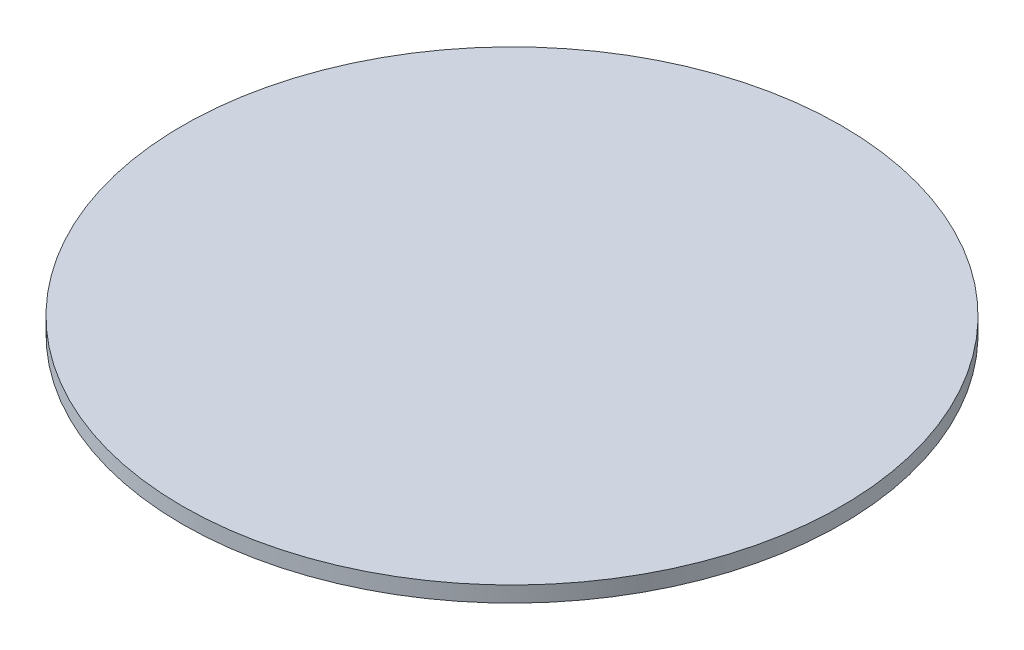
ISO-10303-21;
HEADER;
FILE_DESCRIPTION(('STEP AP214'),'2;1');
FILE_NAME('part.step','',(''),(''),'','','');
FILE_SCHEMA(('AUTOMOTIVE_DESIGN { 1 0 10303 214 1 1 1 1 }'));
ENDSEC;
DATA;
#1=APPLICATION_CONTEXT('core data for automotive mechanical design processes');
#2=APPLICATION_PROTOCOL_DEFINITION('international standard','automotive_design',2000,#1);
#3=PRODUCT_CONTEXT('',#1,'mechanical');
#4=PRODUCT('Part','Part','',(#3));
#5=PRODUCT_RELATED_PRODUCT_CATEGORY('part','',(#4));
#6=PRODUCT_DEFINITION_FORMATION('','',#4);
#7=PRODUCT_DEFINITION_CONTEXT('part definition',#1,'design');
#8=PRODUCT_DEFINITION('design','',#6,#7);
#9=PRODUCT_DEFINITION_SHAPE('','',#8);
#10=(LENGTH_UNIT() NAMED_UNIT(*) SI_UNIT(.MILLI.,.METRE.));
#11=(NAMED_UNIT(*) PLANE_ANGLE_UNIT() SI_UNIT($,.RADIAN.));
#12=(NAMED_UNIT(*) SI_UNIT($,.STERADIAN.) SOLID_ANGLE_UNIT());
#13=UNCERTAINTY_MEASURE_WITH_UNIT(LENGTH_MEASURE(1.E-05),#10,'distance_accuracy_value','');
#14=(GEOMETRIC_REPRESENTATION_CONTEXT(3) GLOBAL_UNCERTAINTY_ASSIGNED_CONTEXT((#13)) GLOBAL_UNIT_ASSIGNED_CONTEXT((#10,
#11,#12)) REPRESENTATION_CONTEXT('',''));
#15=CARTESIAN_POINT('',(0.,0.,0.));
#16=DIRECTION('',(0.,0.,1.));
#17=DIRECTION('',(1.,0.,0.));
#18=AXIS2_PLACEMENT_3D('',#15,#16,#17);
#19=CARTESIAN_POINT('',(0.,5.,0.));
#20=DIRECTION('',(0.,-1.,0.));
#21=DIRECTION('',(0.,0.,-1.));
#22=AXIS2_PLACEMENT_3D('',#19,#20,#21);
#23=CYLINDRICAL_SURFACE('',#22,105.);
#24=CARTESIAN_POINT('',(0.,5.,0.));
#25=DIRECTION('',(0.,1.,0.));
#26=DIRECTION('',(0.,0.,1.));
#27=AXIS2_PLACEMENT_3D('',#24,#25,#26);
#28=CIRCLE('',#27,105.);
#29=CARTESIAN_POINT('',(0.,5.,105.));
#30=VERTEX_POINT('',#29);
#31=EDGE_CURVE('E10',#30,#30,#28,.T.);
#32=ORIENTED_EDGE('',*,*,#31,.F.);
#33=EDGE_LOOP('',(#32));
#34=FACE_BOUND('',#33,.T.);
#35=CARTESIAN_POINT('',(0.,0.,0.));
#36=DIRECTION('',(0.,1.,0.));
#37=DIRECTION('',(0.,0.,1.));
#38=AXIS2_PLACEMENT_3D('',#35,#36,#37);
#39=CIRCLE('',#38,105.);
#40=CARTESIAN_POINT('',(0.,0.,105.));
#41=VERTEX_POINT('',#40);
#42=EDGE_CURVE('E34',#41,#41,#39,.T.);
#43=ORIENTED_EDGE('',*,*,#42,.T.);
#44=EDGE_LOOP('',(#43));
#45=FACE_BOUND('',#44,.T.);
#46=ADVANCED_FACE('F31',(#34,#45),#23,.T.);
#47=CARTESIAN_POINT('',(0.,5.,0.));
#48=DIRECTION('',(0.,1.,0.));
#49=DIRECTION('',(0.,0.,1.));
#50=AXIS2_PLACEMENT_3D('',#47,#48,#49);
#51=PLANE('',#50);
#52=ORIENTED_EDGE('',*,*,#31,.T.);
#53=EDGE_LOOP('',(#52));
#54=FACE_BOUND('',#53,.T.);
#55=ADVANCED_FACE('F46',(#54),#51,.T.);
#56=CARTESIAN_POINT('',(0.,0.,0.));
#57=DIRECTION('',(0.,1.,0.));
#58=DIRECTION('',(0.,0.,1.));
#59=AXIS2_PLACEMENT_3D('',#56,#57,#58);
#60=PLANE('',#59);
#61=ORIENTED_EDGE('',*,*,#42,.F.);
#62=EDGE_LOOP('',(#61));
#63=FACE_BOUND('',#62,.T.);
#64=ADVANCED_FACE('F44',(#63),#60,.F.);
#65=CLOSED_SHELL('',(#46,#55,#64));
#66=MANIFOLD_SOLID_BREP('B2',#65);
#67=ADVANCED_BREP_SHAPE_REPRESENTATION('',(#18,#66),#14);
#68=SHAPE_DEFINITION_REPRESENTATION(#9,#67);
ENDSEC;
END-ISO-10303-21;
